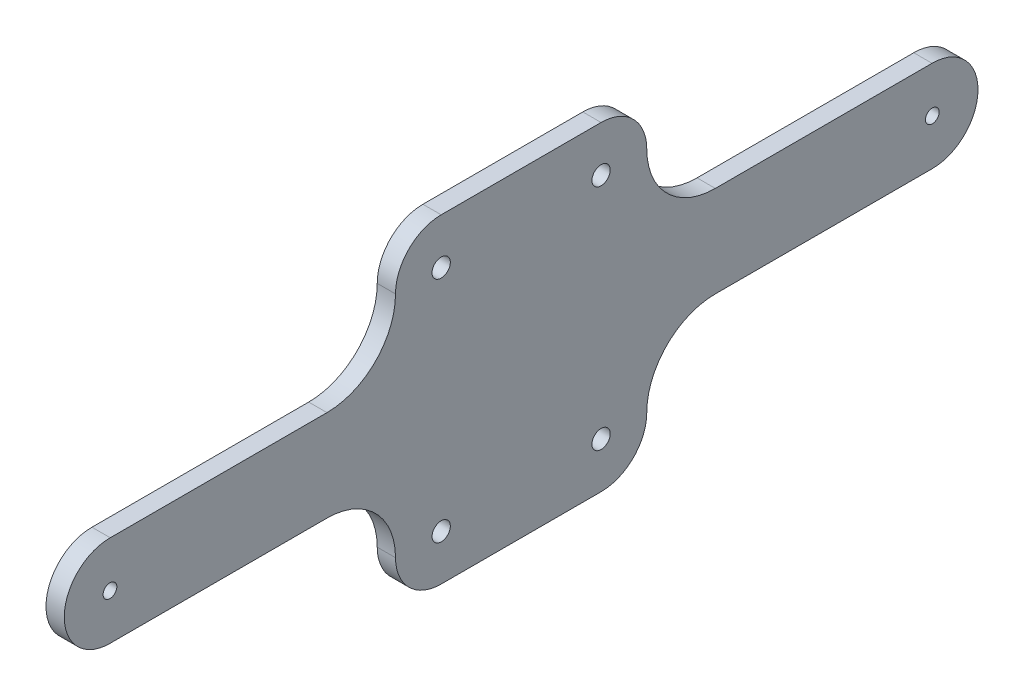
ISO-10303-21;
HEADER;
FILE_DESCRIPTION(('STEP AP214'),'2;1');
FILE_NAME('part.step','',(''),(''),'','','');
FILE_SCHEMA(('AUTOMOTIVE_DESIGN { 1 0 10303 214 1 1 1 1 }'));
ENDSEC;
DATA;
#1=APPLICATION_CONTEXT('core data for automotive mechanical design processes');
#2=APPLICATION_PROTOCOL_DEFINITION('international standard','automotive_design',2000,#1);
#3=PRODUCT_CONTEXT('',#1,'mechanical');
#4=PRODUCT('Part','Part','',(#3));
#5=PRODUCT_RELATED_PRODUCT_CATEGORY('part','',(#4));
#6=PRODUCT_DEFINITION_FORMATION('','',#4);
#7=PRODUCT_DEFINITION_CONTEXT('part definition',#1,'design');
#8=PRODUCT_DEFINITION('design','',#6,#7);
#9=PRODUCT_DEFINITION_SHAPE('','',#8);
#10=(LENGTH_UNIT() NAMED_UNIT(*) SI_UNIT(.MILLI.,.METRE.));
#11=(NAMED_UNIT(*) PLANE_ANGLE_UNIT() SI_UNIT($,.RADIAN.));
#12=(NAMED_UNIT(*) SI_UNIT($,.STERADIAN.) SOLID_ANGLE_UNIT());
#13=UNCERTAINTY_MEASURE_WITH_UNIT(LENGTH_MEASURE(1.E-05),#10,'distance_accuracy_value','');
#14=(GEOMETRIC_REPRESENTATION_CONTEXT(3) GLOBAL_UNCERTAINTY_ASSIGNED_CONTEXT((#13)) GLOBAL_UNIT_ASSIGNED_CONTEXT((#10,
#11,#12)) REPRESENTATION_CONTEXT('',''));
#15=CARTESIAN_POINT('',(0.,0.,0.));
#16=DIRECTION('',(0.,0.,1.));
#17=DIRECTION('',(1.,0.,0.));
#18=AXIS2_PLACEMENT_3D('',#15,#16,#17);
#19=CARTESIAN_POINT('',(4.,0.,0.));
#20=DIRECTION('',(1.,0.,0.));
#21=DIRECTION('',(0.,0.,-1.));
#22=AXIS2_PLACEMENT_3D('',#19,#20,#21);
#23=PLANE('',#22);
#24=CARTESIAN_POINT('',(4.,25.,17.5));
#25=DIRECTION('',(1.,0.,0.));
#26=DIRECTION('',(0.,0.,-1.));
#27=AXIS2_PLACEMENT_3D('',#24,#25,#26);
#28=CIRCLE('',#27,2.);
#29=CARTESIAN_POINT('',(4.,25.,15.5));
#30=VERTEX_POINT('',#29);
#31=EDGE_CURVE('E297',#30,#30,#28,.T.);
#32=ORIENTED_EDGE('',*,*,#31,.F.);
#33=EDGE_LOOP('',(#32));
#34=FACE_BOUND('',#33,.T.);
#35=CARTESIAN_POINT('',(4.,0.,90.));
#36=DIRECTION('',(1.,0.,0.));
#37=DIRECTION('',(0.,0.,-1.));
#38=AXIS2_PLACEMENT_3D('',#35,#36,#37);
#39=CIRCLE('',#38,1.5);
#40=CARTESIAN_POINT('',(4.,0.,88.5));
#41=VERTEX_POINT('',#40);
#42=EDGE_CURVE('E37',#41,#41,#39,.T.);
#43=ORIENTED_EDGE('',*,*,#42,.F.);
#44=EDGE_LOOP('',(#43));
#45=FACE_BOUND('',#44,.T.);
#46=CARTESIAN_POINT('',(4.,-25.,17.5));
#47=DIRECTION('',(-1.,0.,0.));
#48=DIRECTION('',(0.,0.,-1.));
#49=AXIS2_PLACEMENT_3D('',#46,#47,#48);
#50=CIRCLE('',#49,2.);
#51=CARTESIAN_POINT('',(4.,-25.,15.5));
#52=VERTEX_POINT('',#51);
#53=EDGE_CURVE('E260',#52,#52,#50,.T.);
#54=ORIENTED_EDGE('',*,*,#53,.T.);
#55=EDGE_LOOP('',(#54));
#56=FACE_BOUND('',#55,.T.);
#57=CARTESIAN_POINT('',(4.,0.,-90.));
#58=DIRECTION('',(-1.,0.,0.));
#59=DIRECTION('',(0.,0.,1.));
#60=AXIS2_PLACEMENT_3D('',#57,#58,#59);
#61=CIRCLE('',#60,1.5);
#62=CARTESIAN_POINT('',(4.,0.,-88.5));
#63=VERTEX_POINT('',#62);
#64=EDGE_CURVE('E229',#63,#63,#61,.T.);
#65=ORIENTED_EDGE('',*,*,#64,.T.);
#66=EDGE_LOOP('',(#65));
#67=FACE_BOUND('',#66,.T.);
#68=CARTESIAN_POINT('',(4.,25.,-17.5));
#69=DIRECTION('',(-1.,0.,0.));
#70=DIRECTION('',(0.,0.,1.));
#71=AXIS2_PLACEMENT_3D('',#68,#69,#70);
#72=CIRCLE('',#71,2.);
#73=CARTESIAN_POINT('',(4.,25.,-15.5));
#74=VERTEX_POINT('',#73);
#75=EDGE_CURVE('E219',#74,#74,#72,.T.);
#76=ORIENTED_EDGE('',*,*,#75,.T.);
#77=EDGE_LOOP('',(#76));
#78=FACE_BOUND('',#77,.T.);
#79=CARTESIAN_POINT('',(4.,-25.,-17.5));
#80=DIRECTION('',(1.,0.,0.));
#81=DIRECTION('',(0.,0.,1.));
#82=AXIS2_PLACEMENT_3D('',#79,#80,#81);
#83=CIRCLE('',#82,2.);
#84=CARTESIAN_POINT('',(4.,-25.,-15.5));
#85=VERTEX_POINT('',#84);
#86=EDGE_CURVE('E192',#85,#85,#83,.T.);
#87=ORIENTED_EDGE('',*,*,#86,.F.);
#88=EDGE_LOOP('',(#87));
#89=FACE_BOUND('',#88,.T.);
#90=DIRECTION('',(0.,0.,-1.));
#91=VECTOR('',#90,1.);
#92=CARTESIAN_POINT('',(4.,-35.,17.5));
#93=LINE('',#92,#91);
#94=CARTESIAN_POINT('',(4.,-35.,17.5));
#95=VERTEX_POINT('',#94);
#96=CARTESIAN_POINT('',(4.,-35.,-17.5));
#97=VERTEX_POINT('',#96);
#98=EDGE_CURVE('E235',#95,#97,#93,.T.);
#99=ORIENTED_EDGE('',*,*,#98,.T.);
#100=CARTESIAN_POINT('',(4.,-25.,-17.5));
#101=DIRECTION('',(-1.,0.,0.));
#102=DIRECTION('',(0.,0.,1.));
#103=AXIS2_PLACEMENT_3D('',#100,#101,#102);
#104=CIRCLE('',#103,10.);
#105=CARTESIAN_POINT('',(4.,-25.,-27.5));
#106=VERTEX_POINT('',#105);
#107=EDGE_CURVE('E177',#106,#97,#104,.T.);
#108=ORIENTED_EDGE('',*,*,#107,.F.);
#109=CARTESIAN_POINT('',(4.,-25.,-42.5));
#110=DIRECTION('',(1.,0.,0.));
#111=DIRECTION('',(0.,0.,1.));
#112=AXIS2_PLACEMENT_3D('',#109,#110,#111);
#113=CIRCLE('',#112,15.);
#114=CARTESIAN_POINT('',(4.,-10.,-42.5));
#115=VERTEX_POINT('',#114);
#116=EDGE_CURVE('E181',#115,#106,#113,.T.);
#117=ORIENTED_EDGE('',*,*,#116,.F.);
#118=DIRECTION('',(0.,0.,1.));
#119=VECTOR('',#118,1.);
#120=CARTESIAN_POINT('',(4.,-10.,-89.9399542733187));
#121=LINE('',#120,#119);
#122=CARTESIAN_POINT('',(4.,-10.,-89.9399542733187));
#123=VERTEX_POINT('',#122);
#124=EDGE_CURVE('E185',#123,#115,#121,.T.);
#125=ORIENTED_EDGE('',*,*,#124,.F.);
#126=CARTESIAN_POINT('',(4.,0.,-90.));
#127=DIRECTION('',(1.,0.,0.));
#128=DIRECTION('',(0.,0.,1.));
#129=AXIS2_PLACEMENT_3D('',#126,#127,#128);
#130=CIRCLE('',#129,10.0001802728397);
#131=CARTESIAN_POINT('',(4.,10.,-89.9399542733187));
#132=VERTEX_POINT('',#131);
#133=EDGE_CURVE('E167',#123,#132,#130,.T.);
#134=ORIENTED_EDGE('',*,*,#133,.T.);
#135=DIRECTION('',(0.,0.,1.));
#136=VECTOR('',#135,1.);
#137=CARTESIAN_POINT('',(4.,10.,-89.9399542733187));
#138=LINE('',#137,#136);
#139=CARTESIAN_POINT('',(4.,10.,-42.5));
#140=VERTEX_POINT('',#139);
#141=EDGE_CURVE('E213',#132,#140,#138,.T.);
#142=ORIENTED_EDGE('',*,*,#141,.T.);
#143=CARTESIAN_POINT('',(4.,25.,-42.5));
#144=DIRECTION('',(-1.,0.,0.));
#145=DIRECTION('',(0.,0.,1.));
#146=AXIS2_PLACEMENT_3D('',#143,#144,#145);
#147=CIRCLE('',#146,15.);
#148=CARTESIAN_POINT('',(4.,25.,-27.5));
#149=VERTEX_POINT('',#148);
#150=EDGE_CURVE('E210',#140,#149,#147,.T.);
#151=ORIENTED_EDGE('',*,*,#150,.T.);
#152=CARTESIAN_POINT('',(4.,25.,-17.5));
#153=DIRECTION('',(1.,0.,0.));
#154=DIRECTION('',(0.,0.,1.));
#155=AXIS2_PLACEMENT_3D('',#152,#153,#154);
#156=CIRCLE('',#155,10.);
#157=CARTESIAN_POINT('',(4.,35.,-17.5));
#158=VERTEX_POINT('',#157);
#159=EDGE_CURVE('E199',#149,#158,#156,.T.);
#160=ORIENTED_EDGE('',*,*,#159,.T.);
#161=DIRECTION('',(0.,0.,-1.));
#162=VECTOR('',#161,1.);
#163=CARTESIAN_POINT('',(4.,35.,17.5));
#164=LINE('',#163,#162);
#165=CARTESIAN_POINT('',(4.,35.,17.5));
#166=VERTEX_POINT('',#165);
#167=EDGE_CURVE('E275',#166,#158,#164,.T.);
#168=ORIENTED_EDGE('',*,*,#167,.F.);
#169=CARTESIAN_POINT('',(4.,25.,17.5));
#170=DIRECTION('',(-1.,0.,0.));
#171=DIRECTION('',(0.,0.,-1.));
#172=AXIS2_PLACEMENT_3D('',#169,#170,#171);
#173=CIRCLE('',#172,10.);
#174=CARTESIAN_POINT('',(4.,25.,27.5));
#175=VERTEX_POINT('',#174);
#176=EDGE_CURVE('E293',#175,#166,#173,.T.);
#177=ORIENTED_EDGE('',*,*,#176,.F.);
#178=CARTESIAN_POINT('',(4.,25.,42.5));
#179=DIRECTION('',(1.,0.,0.));
#180=DIRECTION('',(0.,0.,-1.));
#181=AXIS2_PLACEMENT_3D('',#178,#179,#180);
#182=CIRCLE('',#181,15.);
#183=CARTESIAN_POINT('',(4.,10.,42.5));
#184=VERTEX_POINT('',#183);
#185=EDGE_CURVE('E290',#184,#175,#182,.T.);
#186=ORIENTED_EDGE('',*,*,#185,.F.);
#187=DIRECTION('',(0.,0.,-1.));
#188=VECTOR('',#187,1.);
#189=CARTESIAN_POINT('',(4.,10.,89.9399542733187));
#190=LINE('',#189,#188);
#191=CARTESIAN_POINT('',(4.,10.,89.9399542733187));
#192=VERTEX_POINT('',#191);
#193=EDGE_CURVE('E288',#192,#184,#190,.T.);
#194=ORIENTED_EDGE('',*,*,#193,.F.);
#195=CARTESIAN_POINT('',(4.,0.,90.));
#196=DIRECTION('',(-1.,0.,0.));
#197=DIRECTION('',(0.,0.,-1.));
#198=AXIS2_PLACEMENT_3D('',#195,#196,#197);
#199=CIRCLE('',#198,10.0001802728397);
#200=CARTESIAN_POINT('',(4.,-10.,89.9399542733187));
#201=VERTEX_POINT('',#200);
#202=EDGE_CURVE('E269',#201,#192,#199,.T.);
#203=ORIENTED_EDGE('',*,*,#202,.F.);
#204=DIRECTION('',(0.,0.,-1.));
#205=VECTOR('',#204,1.);
#206=CARTESIAN_POINT('',(4.,-10.,89.9399542733187));
#207=LINE('',#206,#205);
#208=CARTESIAN_POINT('',(4.,-10.,42.5));
#209=VERTEX_POINT('',#208);
#210=EDGE_CURVE('E241',#201,#209,#207,.T.);
#211=ORIENTED_EDGE('',*,*,#210,.T.);
#212=CARTESIAN_POINT('',(4.,-25.,42.5));
#213=DIRECTION('',(-1.,0.,0.));
#214=DIRECTION('',(0.,0.,-1.));
#215=AXIS2_PLACEMENT_3D('',#212,#213,#214);
#216=CIRCLE('',#215,15.);
#217=CARTESIAN_POINT('',(4.,-25.,27.5));
#218=VERTEX_POINT('',#217);
#219=EDGE_CURVE('E252',#209,#218,#216,.T.);
#220=ORIENTED_EDGE('',*,*,#219,.T.);
#221=CARTESIAN_POINT('',(4.,-25.,17.5));
#222=DIRECTION('',(1.,0.,0.));
#223=DIRECTION('',(0.,0.,-1.));
#224=AXIS2_PLACEMENT_3D('',#221,#222,#223);
#225=CIRCLE('',#224,10.);
#226=EDGE_CURVE('E249',#218,#95,#225,.T.);
#227=ORIENTED_EDGE('',*,*,#226,.T.);
#228=EDGE_LOOP('',(#99,#108,#117,#125,#134,#142,#151,#160,#168,#177,#186,#194,#203,#211,#220,#227));
#229=FACE_BOUND('',#228,.T.);
#230=ADVANCED_FACE('F33',(#34,#45,#56,#67,#78,#89,#229),#23,.T.);
#231=CARTESIAN_POINT('',(0.,0.,0.));
#232=DIRECTION('',(1.,0.,0.));
#233=DIRECTION('',(0.,0.,-1.));
#234=AXIS2_PLACEMENT_3D('',#231,#232,#233);
#235=PLANE('',#234);
#236=CARTESIAN_POINT('',(0.,-25.,-17.5));
#237=DIRECTION('',(1.,0.,0.));
#238=DIRECTION('',(0.,0.,1.));
#239=AXIS2_PLACEMENT_3D('',#236,#237,#238);
#240=CIRCLE('',#239,2.);
#241=CARTESIAN_POINT('',(0.,-25.,-15.5));
#242=VERTEX_POINT('',#241);
#243=EDGE_CURVE('E196',#242,#242,#240,.T.);
#244=ORIENTED_EDGE('',*,*,#243,.T.);
#245=EDGE_LOOP('',(#244));
#246=FACE_BOUND('',#245,.T.);
#247=CARTESIAN_POINT('',(0.,-25.,17.5));
#248=DIRECTION('',(-1.,0.,0.));
#249=DIRECTION('',(0.,0.,-1.));
#250=AXIS2_PLACEMENT_3D('',#247,#248,#249);
#251=CIRCLE('',#250,2.);
#252=CARTESIAN_POINT('',(0.,-25.,15.5));
#253=VERTEX_POINT('',#252);
#254=EDGE_CURVE('E266',#253,#253,#251,.T.);
#255=ORIENTED_EDGE('',*,*,#254,.F.);
#256=EDGE_LOOP('',(#255));
#257=FACE_BOUND('',#256,.T.);
#258=CARTESIAN_POINT('',(0.,25.,17.5));
#259=DIRECTION('',(1.,0.,0.));
#260=DIRECTION('',(0.,0.,-1.));
#261=AXIS2_PLACEMENT_3D('',#258,#259,#260);
#262=CIRCLE('',#261,2.);
#263=CARTESIAN_POINT('',(0.,25.,15.5));
#264=VERTEX_POINT('',#263);
#265=EDGE_CURVE('E302',#264,#264,#262,.T.);
#266=ORIENTED_EDGE('',*,*,#265,.T.);
#267=EDGE_LOOP('',(#266));
#268=FACE_BOUND('',#267,.T.);
#269=CARTESIAN_POINT('',(0.,0.,90.));
#270=DIRECTION('',(1.,0.,0.));
#271=DIRECTION('',(0.,0.,-1.));
#272=AXIS2_PLACEMENT_3D('',#269,#270,#271);
#273=CIRCLE('',#272,1.5);
#274=CARTESIAN_POINT('',(0.,0.,88.5));
#275=VERTEX_POINT('',#274);
#276=EDGE_CURVE('E11',#275,#275,#273,.T.);
#277=ORIENTED_EDGE('',*,*,#276,.T.);
#278=EDGE_LOOP('',(#277));
#279=FACE_BOUND('',#278,.T.);
#280=CARTESIAN_POINT('',(0.,0.,-90.));
#281=DIRECTION('',(-1.,0.,0.));
#282=DIRECTION('',(0.,0.,1.));
#283=AXIS2_PLACEMENT_3D('',#280,#281,#282);
#284=CIRCLE('',#283,1.5);
#285=CARTESIAN_POINT('',(0.,0.,-88.5));
#286=VERTEX_POINT('',#285);
#287=EDGE_CURVE('E232',#286,#286,#284,.T.);
#288=ORIENTED_EDGE('',*,*,#287,.F.);
#289=EDGE_LOOP('',(#288));
#290=FACE_BOUND('',#289,.T.);
#291=CARTESIAN_POINT('',(0.,25.,-17.5));
#292=DIRECTION('',(-1.,0.,0.));
#293=DIRECTION('',(0.,0.,1.));
#294=AXIS2_PLACEMENT_3D('',#291,#292,#293);
#295=CIRCLE('',#294,2.);
#296=CARTESIAN_POINT('',(0.,25.,-15.5));
#297=VERTEX_POINT('',#296);
#298=EDGE_CURVE('E226',#297,#297,#295,.T.);
#299=ORIENTED_EDGE('',*,*,#298,.F.);
#300=EDGE_LOOP('',(#299));
#301=FACE_BOUND('',#300,.T.);
#302=CARTESIAN_POINT('',(0.,-25.,-17.5));
#303=DIRECTION('',(-1.,0.,0.));
#304=DIRECTION('',(0.,0.,1.));
#305=AXIS2_PLACEMENT_3D('',#302,#303,#304);
#306=CIRCLE('',#305,10.);
#307=CARTESIAN_POINT('',(0.,-25.,-27.5));
#308=VERTEX_POINT('',#307);
#309=CARTESIAN_POINT('',(0.,-35.,-17.5));
#310=VERTEX_POINT('',#309);
#311=EDGE_CURVE('E172',#308,#310,#306,.T.);
#312=ORIENTED_EDGE('',*,*,#311,.T.);
#313=DIRECTION('',(0.,0.,-1.));
#314=VECTOR('',#313,1.);
#315=CARTESIAN_POINT('',(0.,-35.,17.5));
#316=LINE('',#315,#314);
#317=CARTESIAN_POINT('',(0.,-35.,17.5));
#318=VERTEX_POINT('',#317);
#319=EDGE_CURVE('E238',#318,#310,#316,.T.);
#320=ORIENTED_EDGE('',*,*,#319,.F.);
#321=CARTESIAN_POINT('',(0.,-25.,17.5));
#322=DIRECTION('',(1.,0.,0.));
#323=DIRECTION('',(0.,0.,-1.));
#324=AXIS2_PLACEMENT_3D('',#321,#322,#323);
#325=CIRCLE('',#324,10.);
#326=CARTESIAN_POINT('',(0.,-25.,27.5));
#327=VERTEX_POINT('',#326);
#328=EDGE_CURVE('E240',#327,#318,#325,.T.);
#329=ORIENTED_EDGE('',*,*,#328,.F.);
#330=CARTESIAN_POINT('',(0.,-25.,42.5));
#331=DIRECTION('',(-1.,0.,0.));
#332=DIRECTION('',(0.,0.,-1.));
#333=AXIS2_PLACEMENT_3D('',#330,#331,#332);
#334=CIRCLE('',#333,15.);
#335=CARTESIAN_POINT('',(0.,-10.,42.5));
#336=VERTEX_POINT('',#335);
#337=EDGE_CURVE('E243',#336,#327,#334,.T.);
#338=ORIENTED_EDGE('',*,*,#337,.F.);
#339=DIRECTION('',(0.,0.,-1.));
#340=VECTOR('',#339,1.);
#341=CARTESIAN_POINT('',(0.,-10.,89.9399542733187));
#342=LINE('',#341,#340);
#343=CARTESIAN_POINT('',(0.,-10.,89.9399542733187));
#344=VERTEX_POINT('',#343);
#345=EDGE_CURVE('E245',#344,#336,#342,.T.);
#346=ORIENTED_EDGE('',*,*,#345,.F.);
#347=CARTESIAN_POINT('',(0.,0.,90.));
#348=DIRECTION('',(-1.,0.,0.));
#349=DIRECTION('',(0.,0.,-1.));
#350=AXIS2_PLACEMENT_3D('',#347,#348,#349);
#351=CIRCLE('',#350,10.0001802728397);
#352=CARTESIAN_POINT('',(0.,10.,89.9399542733187));
#353=VERTEX_POINT('',#352);
#354=EDGE_CURVE('E272',#344,#353,#351,.T.);
#355=ORIENTED_EDGE('',*,*,#354,.T.);
#356=DIRECTION('',(0.,0.,-1.));
#357=VECTOR('',#356,1.);
#358=CARTESIAN_POINT('',(0.,10.,89.9399542733187));
#359=LINE('',#358,#357);
#360=CARTESIAN_POINT('',(0.,10.,42.5));
#361=VERTEX_POINT('',#360);
#362=EDGE_CURVE('E48',#353,#361,#359,.T.);
#363=ORIENTED_EDGE('',*,*,#362,.T.);
#364=CARTESIAN_POINT('',(0.,25.,42.5));
#365=DIRECTION('',(1.,0.,0.));
#366=DIRECTION('',(0.,0.,-1.));
#367=AXIS2_PLACEMENT_3D('',#364,#365,#366);
#368=CIRCLE('',#367,15.);
#369=CARTESIAN_POINT('',(0.,25.,27.5));
#370=VERTEX_POINT('',#369);
#371=EDGE_CURVE('E277',#361,#370,#368,.T.);
#372=ORIENTED_EDGE('',*,*,#371,.T.);
#373=CARTESIAN_POINT('',(0.,25.,17.5));
#374=DIRECTION('',(-1.,0.,0.));
#375=DIRECTION('',(0.,0.,-1.));
#376=AXIS2_PLACEMENT_3D('',#373,#374,#375);
#377=CIRCLE('',#376,10.);
#378=CARTESIAN_POINT('',(0.,35.,17.5));
#379=VERTEX_POINT('',#378);
#380=EDGE_CURVE('E280',#370,#379,#377,.T.);
#381=ORIENTED_EDGE('',*,*,#380,.T.);
#382=DIRECTION('',(0.,0.,-1.));
#383=VECTOR('',#382,1.);
#384=CARTESIAN_POINT('',(0.,35.,17.5));
#385=LINE('',#384,#383);
#386=CARTESIAN_POINT('',(0.,35.,-17.5));
#387=VERTEX_POINT('',#386);
#388=EDGE_CURVE('E283',#379,#387,#385,.T.);
#389=ORIENTED_EDGE('',*,*,#388,.T.);
#390=CARTESIAN_POINT('',(0.,25.,-17.5));
#391=DIRECTION('',(1.,0.,0.));
#392=DIRECTION('',(0.,0.,1.));
#393=AXIS2_PLACEMENT_3D('',#390,#391,#392);
#394=CIRCLE('',#393,10.);
#395=CARTESIAN_POINT('',(0.,25.,-27.5));
#396=VERTEX_POINT('',#395);
#397=EDGE_CURVE('E202',#396,#387,#394,.T.);
#398=ORIENTED_EDGE('',*,*,#397,.F.);
#399=CARTESIAN_POINT('',(0.,25.,-42.5));
#400=DIRECTION('',(-1.,0.,0.));
#401=DIRECTION('',(0.,0.,1.));
#402=AXIS2_PLACEMENT_3D('',#399,#400,#401);
#403=CIRCLE('',#402,15.);
#404=CARTESIAN_POINT('',(0.,10.,-42.5));
#405=VERTEX_POINT('',#404);
#406=EDGE_CURVE('E205',#405,#396,#403,.T.);
#407=ORIENTED_EDGE('',*,*,#406,.F.);
#408=DIRECTION('',(0.,0.,1.));
#409=VECTOR('',#408,1.);
#410=CARTESIAN_POINT('',(0.,10.,-89.9399542733187));
#411=LINE('',#410,#409);
#412=CARTESIAN_POINT('',(0.,10.,-89.9399542733187));
#413=VERTEX_POINT('',#412);
#414=EDGE_CURVE('E158',#413,#405,#411,.T.);
#415=ORIENTED_EDGE('',*,*,#414,.F.);
#416=CARTESIAN_POINT('',(0.,0.,-90.));
#417=DIRECTION('',(1.,0.,0.));
#418=DIRECTION('',(0.,0.,1.));
#419=AXIS2_PLACEMENT_3D('',#416,#417,#418);
#420=CIRCLE('',#419,10.0001802728397);
#421=CARTESIAN_POINT('',(0.,-10.,-89.9399542733187));
#422=VERTEX_POINT('',#421);
#423=EDGE_CURVE('E151',#422,#413,#420,.T.);
#424=ORIENTED_EDGE('',*,*,#423,.F.);
#425=DIRECTION('',(0.,0.,1.));
#426=VECTOR('',#425,1.);
#427=CARTESIAN_POINT('',(0.,-10.,-89.9399542733187));
#428=LINE('',#427,#426);
#429=CARTESIAN_POINT('',(0.,-10.,-42.5));
#430=VERTEX_POINT('',#429);
#431=EDGE_CURVE('E156',#422,#430,#428,.T.);
#432=ORIENTED_EDGE('',*,*,#431,.T.);
#433=CARTESIAN_POINT('',(0.,-25.,-42.5));
#434=DIRECTION('',(1.,0.,0.));
#435=DIRECTION('',(0.,0.,1.));
#436=AXIS2_PLACEMENT_3D('',#433,#434,#435);
#437=CIRCLE('',#436,15.);
#438=EDGE_CURVE('E176',#430,#308,#437,.T.);
#439=ORIENTED_EDGE('',*,*,#438,.T.);
#440=EDGE_LOOP('',(#312,#320,#329,#338,#346,#355,#363,#372,#381,#389,#398,#407,#415,#424,#432,#439));
#441=FACE_BOUND('',#440,.T.);
#442=ADVANCED_FACE('F35',(#246,#257,#268,#279,#290,#301,#441),#235,.F.);
#443=CARTESIAN_POINT('',(0.,0.,90.));
#444=DIRECTION('',(1.,0.,0.));
#445=DIRECTION('',(0.,0.,-1.));
#446=AXIS2_PLACEMENT_3D('',#443,#444,#445);
#447=CYLINDRICAL_SURFACE('',#446,1.5);
#448=ORIENTED_EDGE('',*,*,#276,.F.);
#449=EDGE_LOOP('',(#448));
#450=FACE_BOUND('',#449,.T.);
#451=ORIENTED_EDGE('',*,*,#42,.T.);
#452=EDGE_LOOP('',(#451));
#453=FACE_BOUND('',#452,.T.);
#454=ADVANCED_FACE('F402',(#450,#453),#447,.F.);
#455=CARTESIAN_POINT('',(0.,25.,17.5));
#456=DIRECTION('',(1.,0.,0.));
#457=DIRECTION('',(0.,0.,-1.));
#458=AXIS2_PLACEMENT_3D('',#455,#456,#457);
#459=CYLINDRICAL_SURFACE('',#458,2.);
#460=ORIENTED_EDGE('',*,*,#265,.F.);
#461=EDGE_LOOP('',(#460));
#462=FACE_BOUND('',#461,.T.);
#463=ORIENTED_EDGE('',*,*,#31,.T.);
#464=EDGE_LOOP('',(#463));
#465=FACE_BOUND('',#464,.T.);
#466=ADVANCED_FACE('F308',(#462,#465),#459,.F.);
#467=CARTESIAN_POINT('',(0.,35.,17.5));
#468=DIRECTION('',(0.,-1.,0.));
#469=DIRECTION('',(0.,0.,-1.));
#470=AXIS2_PLACEMENT_3D('',#467,#468,#469);
#471=PLANE('',#470);
#472=ORIENTED_EDGE('',*,*,#167,.T.);
#473=DIRECTION('',(1.,0.,0.));
#474=VECTOR('',#473,1.);
#475=CARTESIAN_POINT('',(0.,35.,-17.5));
#476=LINE('',#475,#474);
#477=EDGE_CURVE('E161',#387,#158,#476,.T.);
#478=ORIENTED_EDGE('',*,*,#477,.F.);
#479=ORIENTED_EDGE('',*,*,#388,.F.);
#480=DIRECTION('',(1.,0.,0.));
#481=VECTOR('',#480,1.);
#482=CARTESIAN_POINT('',(0.,35.,17.5));
#483=LINE('',#482,#481);
#484=EDGE_CURVE('E57',#379,#166,#483,.T.);
#485=ORIENTED_EDGE('',*,*,#484,.T.);
#486=EDGE_LOOP('',(#472,#478,#479,#485));
#487=FACE_BOUND('',#486,.T.);
#488=ADVANCED_FACE('F353',(#487),#471,.F.);
#489=CARTESIAN_POINT('',(0.,25.,17.5));
#490=DIRECTION('',(1.,0.,0.));
#491=DIRECTION('',(0.,0.,-1.));
#492=AXIS2_PLACEMENT_3D('',#489,#490,#491);
#493=CYLINDRICAL_SURFACE('',#492,10.);
#494=ORIENTED_EDGE('',*,*,#176,.T.);
#495=ORIENTED_EDGE('',*,*,#484,.F.);
#496=ORIENTED_EDGE('',*,*,#380,.F.);
#497=DIRECTION('',(1.,0.,0.));
#498=VECTOR('',#497,1.);
#499=CARTESIAN_POINT('',(0.,25.,27.5));
#500=LINE('',#499,#498);
#501=EDGE_CURVE('E298',#370,#175,#500,.T.);
#502=ORIENTED_EDGE('',*,*,#501,.T.);
#503=EDGE_LOOP('',(#494,#495,#496,#502));
#504=FACE_BOUND('',#503,.T.);
#505=ADVANCED_FACE('F354',(#504),#493,.T.);
#506=CARTESIAN_POINT('',(0.,25.,42.5));
#507=DIRECTION('',(1.,0.,0.));
#508=DIRECTION('',(0.,0.,-1.));
#509=AXIS2_PLACEMENT_3D('',#506,#507,#508);
#510=CYLINDRICAL_SURFACE('',#509,15.);
#511=ORIENTED_EDGE('',*,*,#185,.T.);
#512=ORIENTED_EDGE('',*,*,#501,.F.);
#513=ORIENTED_EDGE('',*,*,#371,.F.);
#514=DIRECTION('',(1.,0.,0.));
#515=VECTOR('',#514,1.);
#516=CARTESIAN_POINT('',(0.,10.,42.5));
#517=LINE('',#516,#515);
#518=EDGE_CURVE('E76',#361,#184,#517,.T.);
#519=ORIENTED_EDGE('',*,*,#518,.T.);
#520=EDGE_LOOP('',(#511,#512,#513,#519));
#521=FACE_BOUND('',#520,.T.);
#522=ADVANCED_FACE('F356',(#521),#510,.F.);
#523=CARTESIAN_POINT('',(0.,10.,89.9399542733187));
#524=DIRECTION('',(0.,-1.,0.));
#525=DIRECTION('',(0.,0.,-1.));
#526=AXIS2_PLACEMENT_3D('',#523,#524,#525);
#527=PLANE('',#526);
#528=ORIENTED_EDGE('',*,*,#193,.T.);
#529=ORIENTED_EDGE('',*,*,#518,.F.);
#530=ORIENTED_EDGE('',*,*,#362,.F.);
#531=DIRECTION('',(1.,0.,0.));
#532=VECTOR('',#531,1.);
#533=CARTESIAN_POINT('',(0.,10.,89.9399542733187));
#534=LINE('',#533,#532);
#535=EDGE_CURVE('E285',#353,#192,#534,.T.);
#536=ORIENTED_EDGE('',*,*,#535,.T.);
#537=EDGE_LOOP('',(#528,#529,#530,#536));
#538=FACE_BOUND('',#537,.T.);
#539=ADVANCED_FACE('F358',(#538),#527,.F.);
#540=CARTESIAN_POINT('',(0.,0.,90.));
#541=DIRECTION('',(1.,0.,0.));
#542=DIRECTION('',(0.,0.,-1.));
#543=AXIS2_PLACEMENT_3D('',#540,#541,#542);
#544=CYLINDRICAL_SURFACE('',#543,10.0001802728397);
#545=ORIENTED_EDGE('',*,*,#202,.T.);
#546=ORIENTED_EDGE('',*,*,#535,.F.);
#547=ORIENTED_EDGE('',*,*,#354,.F.);
#548=DIRECTION('',(1.,0.,0.));
#549=VECTOR('',#548,1.);
#550=CARTESIAN_POINT('',(0.,-10.,89.9399542733187));
#551=LINE('',#550,#549);
#552=EDGE_CURVE('E257',#344,#201,#551,.T.);
#553=ORIENTED_EDGE('',*,*,#552,.T.);
#554=EDGE_LOOP('',(#545,#546,#547,#553));
#555=FACE_BOUND('',#554,.T.);
#556=ADVANCED_FACE('F360',(#555),#544,.T.);
#557=CARTESIAN_POINT('',(0.,-25.,17.5));
#558=DIRECTION('',(1.,0.,0.));
#559=DIRECTION('',(0.,0.,-1.));
#560=AXIS2_PLACEMENT_3D('',#557,#558,#559);
#561=CYLINDRICAL_SURFACE('',#560,2.);
#562=ORIENTED_EDGE('',*,*,#254,.T.);
#563=EDGE_LOOP('',(#562));
#564=FACE_BOUND('',#563,.T.);
#565=ORIENTED_EDGE('',*,*,#53,.F.);
#566=EDGE_LOOP('',(#565));
#567=FACE_BOUND('',#566,.T.);
#568=ADVANCED_FACE('F386',(#564,#567),#561,.F.);
#569=CARTESIAN_POINT('',(0.,-10.,89.9399542733187));
#570=DIRECTION('',(0.,-1.,0.));
#571=DIRECTION('',(0.,0.,-1.));
#572=AXIS2_PLACEMENT_3D('',#569,#570,#571);
#573=PLANE('',#572);
#574=ORIENTED_EDGE('',*,*,#210,.F.);
#575=ORIENTED_EDGE('',*,*,#552,.F.);
#576=ORIENTED_EDGE('',*,*,#345,.T.);
#577=DIRECTION('',(1.,0.,0.));
#578=VECTOR('',#577,1.);
#579=CARTESIAN_POINT('',(0.,-10.,42.5));
#580=LINE('',#579,#578);
#581=EDGE_CURVE('E261',#336,#209,#580,.T.);
#582=ORIENTED_EDGE('',*,*,#581,.T.);
#583=EDGE_LOOP('',(#574,#575,#576,#582));
#584=FACE_BOUND('',#583,.T.);
#585=ADVANCED_FACE('F365',(#584),#573,.T.);
#586=CARTESIAN_POINT('',(0.,-25.,42.5));
#587=DIRECTION('',(1.,0.,0.));
#588=DIRECTION('',(0.,0.,-1.));
#589=AXIS2_PLACEMENT_3D('',#586,#587,#588);
#590=CYLINDRICAL_SURFACE('',#589,15.);
#591=ORIENTED_EDGE('',*,*,#219,.F.);
#592=ORIENTED_EDGE('',*,*,#581,.F.);
#593=ORIENTED_EDGE('',*,*,#337,.T.);
#594=DIRECTION('',(1.,0.,0.));
#595=VECTOR('',#594,1.);
#596=CARTESIAN_POINT('',(0.,-25.,27.5));
#597=LINE('',#596,#595);
#598=EDGE_CURVE('E263',#327,#218,#597,.T.);
#599=ORIENTED_EDGE('',*,*,#598,.T.);
#600=EDGE_LOOP('',(#591,#592,#593,#599));
#601=FACE_BOUND('',#600,.T.);
#602=ADVANCED_FACE('F369',(#601),#590,.F.);
#603=CARTESIAN_POINT('',(0.,-25.,17.5));
#604=DIRECTION('',(1.,0.,0.));
#605=DIRECTION('',(0.,0.,-1.));
#606=AXIS2_PLACEMENT_3D('',#603,#604,#605);
#607=CYLINDRICAL_SURFACE('',#606,10.);
#608=ORIENTED_EDGE('',*,*,#226,.F.);
#609=ORIENTED_EDGE('',*,*,#598,.F.);
#610=ORIENTED_EDGE('',*,*,#328,.T.);
#611=DIRECTION('',(1.,0.,0.));
#612=VECTOR('',#611,1.);
#613=CARTESIAN_POINT('',(0.,-35.,17.5));
#614=LINE('',#613,#612);
#615=EDGE_CURVE('E247',#318,#95,#614,.T.);
#616=ORIENTED_EDGE('',*,*,#615,.T.);
#617=EDGE_LOOP('',(#608,#609,#610,#616));
#618=FACE_BOUND('',#617,.T.);
#619=ADVANCED_FACE('F374',(#618),#607,.T.);
#620=CARTESIAN_POINT('',(0.,-35.,17.5));
#621=DIRECTION('',(0.,-1.,0.));
#622=DIRECTION('',(0.,0.,-1.));
#623=AXIS2_PLACEMENT_3D('',#620,#621,#622);
#624=PLANE('',#623);
#625=ORIENTED_EDGE('',*,*,#98,.F.);
#626=ORIENTED_EDGE('',*,*,#615,.F.);
#627=ORIENTED_EDGE('',*,*,#319,.T.);
#628=DIRECTION('',(1.,0.,0.));
#629=VECTOR('',#628,1.);
#630=CARTESIAN_POINT('',(0.,-35.,-17.5));
#631=LINE('',#630,#629);
#632=EDGE_CURVE('E189',#310,#97,#631,.T.);
#633=ORIENTED_EDGE('',*,*,#632,.T.);
#634=EDGE_LOOP('',(#625,#626,#627,#633));
#635=FACE_BOUND('',#634,.T.);
#636=ADVANCED_FACE('F330',(#635),#624,.T.);
#637=CARTESIAN_POINT('',(0.,0.,-90.));
#638=DIRECTION('',(1.,0.,0.));
#639=DIRECTION('',(0.,0.,-1.));
#640=AXIS2_PLACEMENT_3D('',#637,#638,#639);
#641=CYLINDRICAL_SURFACE('',#640,1.5);
#642=ORIENTED_EDGE('',*,*,#287,.T.);
#643=EDGE_LOOP('',(#642));
#644=FACE_BOUND('',#643,.T.);
#645=ORIENTED_EDGE('',*,*,#64,.F.);
#646=EDGE_LOOP('',(#645));
#647=FACE_BOUND('',#646,.T.);
#648=ADVANCED_FACE('F381',(#644,#647),#641,.F.);
#649=CARTESIAN_POINT('',(0.,25.,-17.5));
#650=DIRECTION('',(1.,0.,0.));
#651=DIRECTION('',(0.,0.,-1.));
#652=AXIS2_PLACEMENT_3D('',#649,#650,#651);
#653=CYLINDRICAL_SURFACE('',#652,2.);
#654=ORIENTED_EDGE('',*,*,#298,.T.);
#655=EDGE_LOOP('',(#654));
#656=FACE_BOUND('',#655,.T.);
#657=ORIENTED_EDGE('',*,*,#75,.F.);
#658=EDGE_LOOP('',(#657));
#659=FACE_BOUND('',#658,.T.);
#660=ADVANCED_FACE('F418',(#656,#659),#653,.F.);
#661=CARTESIAN_POINT('',(0.,0.,-90.));
#662=DIRECTION('',(1.,0.,0.));
#663=DIRECTION('',(0.,0.,-1.));
#664=AXIS2_PLACEMENT_3D('',#661,#662,#663);
#665=CYLINDRICAL_SURFACE('',#664,10.0001802728397);
#666=ORIENTED_EDGE('',*,*,#133,.F.);
#667=DIRECTION('',(1.,0.,0.));
#668=VECTOR('',#667,1.);
#669=CARTESIAN_POINT('',(0.,-10.,-89.9399542733187));
#670=LINE('',#669,#668);
#671=EDGE_CURVE('E164',#422,#123,#670,.T.);
#672=ORIENTED_EDGE('',*,*,#671,.F.);
#673=ORIENTED_EDGE('',*,*,#423,.T.);
#674=DIRECTION('',(1.,0.,0.));
#675=VECTOR('',#674,1.);
#676=CARTESIAN_POINT('',(0.,10.,-89.9399542733187));
#677=LINE('',#676,#675);
#678=EDGE_CURVE('E217',#413,#132,#677,.T.);
#679=ORIENTED_EDGE('',*,*,#678,.T.);
#680=EDGE_LOOP('',(#666,#672,#673,#679));
#681=FACE_BOUND('',#680,.T.);
#682=ADVANCED_FACE('F165',(#681),#665,.T.);
#683=CARTESIAN_POINT('',(0.,10.,-89.9399542733187));
#684=DIRECTION('',(0.,1.,0.));
#685=DIRECTION('',(0.,0.,1.));
#686=AXIS2_PLACEMENT_3D('',#683,#684,#685);
#687=PLANE('',#686);
#688=ORIENTED_EDGE('',*,*,#141,.F.);
#689=ORIENTED_EDGE('',*,*,#678,.F.);
#690=ORIENTED_EDGE('',*,*,#414,.T.);
#691=DIRECTION('',(1.,0.,0.));
#692=VECTOR('',#691,1.);
#693=CARTESIAN_POINT('',(0.,10.,-42.5));
#694=LINE('',#693,#692);
#695=EDGE_CURVE('E220',#405,#140,#694,.T.);
#696=ORIENTED_EDGE('',*,*,#695,.T.);
#697=EDGE_LOOP('',(#688,#689,#690,#696));
#698=FACE_BOUND('',#697,.T.);
#699=ADVANCED_FACE('F340',(#698),#687,.T.);
#700=CARTESIAN_POINT('',(0.,25.,-42.5));
#701=DIRECTION('',(1.,0.,0.));
#702=DIRECTION('',(0.,0.,-1.));
#703=AXIS2_PLACEMENT_3D('',#700,#701,#702);
#704=CYLINDRICAL_SURFACE('',#703,15.);
#705=ORIENTED_EDGE('',*,*,#150,.F.);
#706=ORIENTED_EDGE('',*,*,#695,.F.);
#707=ORIENTED_EDGE('',*,*,#406,.T.);
#708=DIRECTION('',(1.,0.,0.));
#709=VECTOR('',#708,1.);
#710=CARTESIAN_POINT('',(0.,25.,-27.5));
#711=LINE('',#710,#709);
#712=EDGE_CURVE('E222',#396,#149,#711,.T.);
#713=ORIENTED_EDGE('',*,*,#712,.T.);
#714=EDGE_LOOP('',(#705,#706,#707,#713));
#715=FACE_BOUND('',#714,.T.);
#716=ADVANCED_FACE('F343',(#715),#704,.F.);
#717=CARTESIAN_POINT('',(0.,25.,-17.5));
#718=DIRECTION('',(1.,0.,0.));
#719=DIRECTION('',(0.,0.,-1.));
#720=AXIS2_PLACEMENT_3D('',#717,#718,#719);
#721=CYLINDRICAL_SURFACE('',#720,10.);
#722=ORIENTED_EDGE('',*,*,#159,.F.);
#723=ORIENTED_EDGE('',*,*,#712,.F.);
#724=ORIENTED_EDGE('',*,*,#397,.T.);
#725=ORIENTED_EDGE('',*,*,#477,.T.);
#726=EDGE_LOOP('',(#722,#723,#724,#725));
#727=FACE_BOUND('',#726,.T.);
#728=ADVANCED_FACE('F348',(#727),#721,.T.);
#729=CARTESIAN_POINT('',(0.,-25.,-17.5));
#730=DIRECTION('',(1.,0.,0.));
#731=DIRECTION('',(0.,0.,-1.));
#732=AXIS2_PLACEMENT_3D('',#729,#730,#731);
#733=CYLINDRICAL_SURFACE('',#732,2.);
#734=ORIENTED_EDGE('',*,*,#243,.F.);
#735=EDGE_LOOP('',(#734));
#736=FACE_BOUND('',#735,.T.);
#737=ORIENTED_EDGE('',*,*,#86,.T.);
#738=EDGE_LOOP('',(#737));
#739=FACE_BOUND('',#738,.T.);
#740=ADVANCED_FACE('F513',(#736,#739),#733,.F.);
#741=CARTESIAN_POINT('',(0.,-25.,-17.5));
#742=DIRECTION('',(1.,0.,0.));
#743=DIRECTION('',(0.,0.,-1.));
#744=AXIS2_PLACEMENT_3D('',#741,#742,#743);
#745=CYLINDRICAL_SURFACE('',#744,10.);
#746=ORIENTED_EDGE('',*,*,#107,.T.);
#747=ORIENTED_EDGE('',*,*,#632,.F.);
#748=ORIENTED_EDGE('',*,*,#311,.F.);
#749=DIRECTION('',(1.,0.,0.));
#750=VECTOR('',#749,1.);
#751=CARTESIAN_POINT('',(0.,-25.,-27.5));
#752=LINE('',#751,#750);
#753=EDGE_CURVE('E193',#308,#106,#752,.T.);
#754=ORIENTED_EDGE('',*,*,#753,.T.);
#755=EDGE_LOOP('',(#746,#747,#748,#754));
#756=FACE_BOUND('',#755,.T.);
#757=ADVANCED_FACE('F334',(#756),#745,.T.);
#758=CARTESIAN_POINT('',(0.,-25.,-42.5));
#759=DIRECTION('',(1.,0.,0.));
#760=DIRECTION('',(0.,0.,-1.));
#761=AXIS2_PLACEMENT_3D('',#758,#759,#760);
#762=CYLINDRICAL_SURFACE('',#761,15.);
#763=ORIENTED_EDGE('',*,*,#116,.T.);
#764=ORIENTED_EDGE('',*,*,#753,.F.);
#765=ORIENTED_EDGE('',*,*,#438,.F.);
#766=DIRECTION('',(1.,0.,0.));
#767=VECTOR('',#766,1.);
#768=CARTESIAN_POINT('',(0.,-10.,-42.5));
#769=LINE('',#768,#767);
#770=EDGE_CURVE('E171',#430,#115,#769,.T.);
#771=ORIENTED_EDGE('',*,*,#770,.T.);
#772=EDGE_LOOP('',(#763,#764,#765,#771));
#773=FACE_BOUND('',#772,.T.);
#774=ADVANCED_FACE('F336',(#773),#762,.F.);
#775=CARTESIAN_POINT('',(0.,-10.,-89.9399542733187));
#776=DIRECTION('',(0.,1.,0.));
#777=DIRECTION('',(0.,0.,1.));
#778=AXIS2_PLACEMENT_3D('',#775,#776,#777);
#779=PLANE('',#778);
#780=ORIENTED_EDGE('',*,*,#124,.T.);
#781=ORIENTED_EDGE('',*,*,#770,.F.);
#782=ORIENTED_EDGE('',*,*,#431,.F.);
#783=ORIENTED_EDGE('',*,*,#671,.T.);
#784=EDGE_LOOP('',(#780,#781,#782,#783));
#785=FACE_BOUND('',#784,.T.);
#786=ADVANCED_FACE('F174',(#785),#779,.F.);
#787=CLOSED_SHELL('',(#230,#442,#454,#466,#488,#505,#522,#539,#556,#568,#585,#602,#619,#636,
#648,#660,#682,#699,#716,#728,#740,#757,#774,#786));
#788=MANIFOLD_SOLID_BREP('B2',#787);
#789=ADVANCED_BREP_SHAPE_REPRESENTATION('',(#18,#788),#14);
#790=SHAPE_DEFINITION_REPRESENTATION(#9,#789);
ENDSEC;
END-ISO-10303-21;
